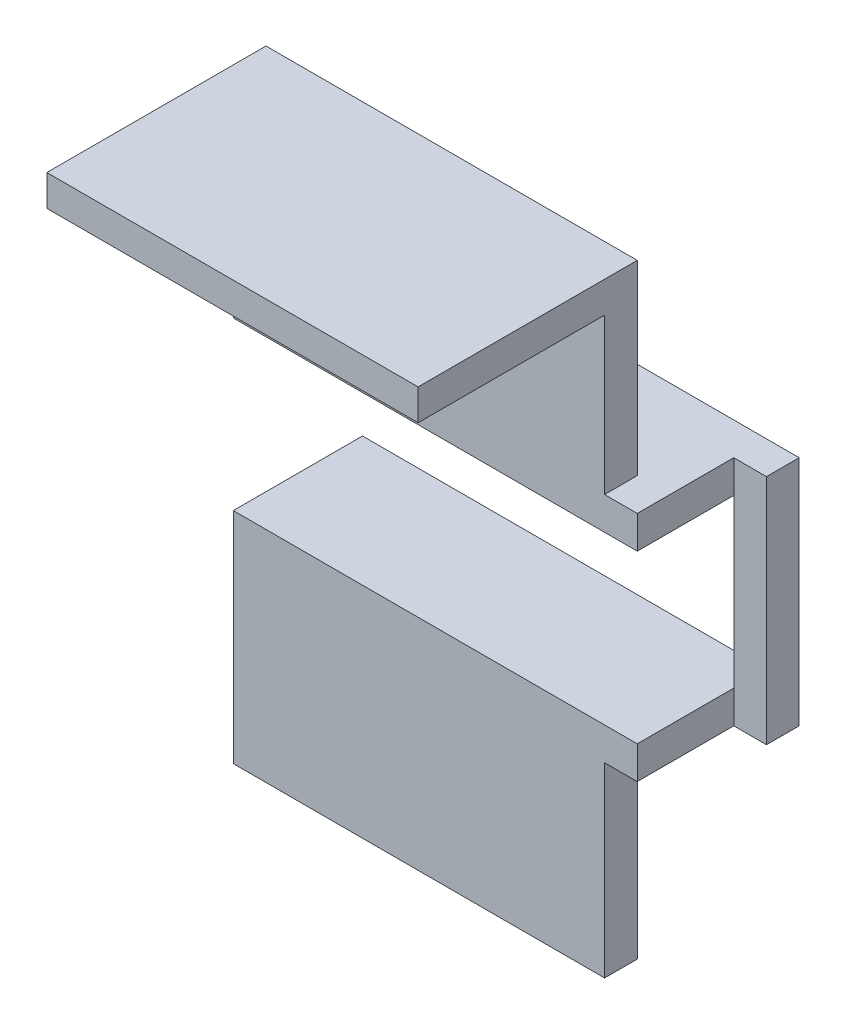
ISO-10303-21;
HEADER;
FILE_DESCRIPTION(('STEP AP214'),'2;1');
FILE_NAME('part.step','',(''),(''),'','','');
FILE_SCHEMA(('AUTOMOTIVE_DESIGN { 1 0 10303 214 1 1 1 1 }'));
ENDSEC;
DATA;
#1=APPLICATION_CONTEXT('core data for automotive mechanical design processes');
#2=APPLICATION_PROTOCOL_DEFINITION('international standard','automotive_design',2000,#1);
#3=PRODUCT_CONTEXT('',#1,'mechanical');
#4=PRODUCT('Part','Part','',(#3));
#5=PRODUCT_RELATED_PRODUCT_CATEGORY('part','',(#4));
#6=PRODUCT_DEFINITION_FORMATION('','',#4);
#7=PRODUCT_DEFINITION_CONTEXT('part definition',#1,'design');
#8=PRODUCT_DEFINITION('design','',#6,#7);
#9=PRODUCT_DEFINITION_SHAPE('','',#8);
#10=(LENGTH_UNIT() NAMED_UNIT(*) SI_UNIT(.MILLI.,.METRE.));
#11=(NAMED_UNIT(*) PLANE_ANGLE_UNIT() SI_UNIT($,.RADIAN.));
#12=(NAMED_UNIT(*) SI_UNIT($,.STERADIAN.) SOLID_ANGLE_UNIT());
#13=UNCERTAINTY_MEASURE_WITH_UNIT(LENGTH_MEASURE(1.E-05),#10,'distance_accuracy_value','');
#14=(GEOMETRIC_REPRESENTATION_CONTEXT(3) GLOBAL_UNCERTAINTY_ASSIGNED_CONTEXT((#13)) GLOBAL_UNIT_ASSIGNED_CONTEXT((#10,
#11,#12)) REPRESENTATION_CONTEXT('',''));
#15=CARTESIAN_POINT('',(0.,0.,0.));
#16=DIRECTION('',(0.,0.,1.));
#17=DIRECTION('',(1.,0.,0.));
#18=AXIS2_PLACEMENT_3D('',#15,#16,#17);
#19=CARTESIAN_POINT('',(9.9,13.4,4.));
#20=DIRECTION('',(-1.,0.,0.));
#21=DIRECTION('',(0.,0.,1.));
#22=AXIS2_PLACEMENT_3D('',#19,#20,#21);
#23=PLANE('',#22);
#24=DIRECTION('',(0.,-1.,0.));
#25=VECTOR('',#24,1.);
#26=CARTESIAN_POINT('',(9.9,11.4,-7.8));
#27=LINE('',#26,#25);
#28=CARTESIAN_POINT('',(9.9,15.4,-7.8));
#29=VERTEX_POINT('',#28);
#30=CARTESIAN_POINT('',(9.9,11.4,-7.8));
#31=VERTEX_POINT('',#30);
#32=EDGE_CURVE('E11',#29,#31,#27,.T.);
#33=ORIENTED_EDGE('',*,*,#32,.F.);
#34=DIRECTION('',(0.,0.,-1.));
#35=VECTOR('',#34,1.);
#36=CARTESIAN_POINT('',(9.9,15.4,0.));
#37=LINE('',#36,#35);
#38=CARTESIAN_POINT('',(9.9,15.4,4.));
#39=VERTEX_POINT('',#38);
#40=EDGE_CURVE('E294',#39,#29,#37,.T.);
#41=ORIENTED_EDGE('',*,*,#40,.F.);
#42=DIRECTION('',(0.,-1.,0.));
#43=VECTOR('',#42,1.);
#44=CARTESIAN_POINT('',(9.9,13.4,4.));
#45=LINE('',#44,#43);
#46=CARTESIAN_POINT('',(9.9,11.4,4.));
#47=VERTEX_POINT('',#46);
#48=EDGE_CURVE('E300',#39,#47,#45,.T.);
#49=ORIENTED_EDGE('',*,*,#48,.T.);
#50=DIRECTION('',(0.,0.,-1.));
#51=VECTOR('',#50,1.);
#52=CARTESIAN_POINT('',(9.9,11.4,4.));
#53=LINE('',#52,#51);
#54=EDGE_CURVE('E298',#47,#31,#53,.T.);
#55=ORIENTED_EDGE('',*,*,#54,.T.);
#56=EDGE_LOOP('',(#33,#41,#49,#55));
#57=FACE_BOUND('',#56,.T.);
#58=ADVANCED_FACE('F37',(#57),#23,.F.);
#59=CARTESIAN_POINT('',(0.,0.,0.));
#60=DIRECTION('',(0.,0.,1.));
#61=DIRECTION('',(1.,0.,0.));
#62=AXIS2_PLACEMENT_3D('',#59,#60,#61);
#63=PLANE('',#62);
#64=DIRECTION('',(-1.,0.,0.));
#65=VECTOR('',#64,1.);
#66=CARTESIAN_POINT('',(9.9,11.4,0.));
#67=LINE('',#66,#65);
#68=CARTESIAN_POINT('',(5.9,11.4,0.));
#69=VERTEX_POINT('',#68);
#70=CARTESIAN_POINT('',(-39.5,11.4,0.));
#71=VERTEX_POINT('',#70);
#72=EDGE_CURVE('E46',#69,#71,#67,.T.);
#73=ORIENTED_EDGE('',*,*,#72,.F.);
#74=DIRECTION('',(0.,1.,0.));
#75=VECTOR('',#74,1.);
#76=CARTESIAN_POINT('',(5.9,11.4,0.));
#77=LINE('',#76,#75);
#78=CARTESIAN_POINT('',(5.9,-11.4,0.));
#79=VERTEX_POINT('',#78);
#80=EDGE_CURVE('E307',#79,#69,#77,.T.);
#81=ORIENTED_EDGE('',*,*,#80,.F.);
#82=DIRECTION('',(1.,0.,0.));
#83=VECTOR('',#82,1.);
#84=CARTESIAN_POINT('',(-5.9,-11.4,0.));
#85=LINE('',#84,#83);
#86=CARTESIAN_POINT('',(-39.5,-11.4,0.));
#87=VERTEX_POINT('',#86);
#88=EDGE_CURVE('E303',#87,#79,#85,.T.);
#89=ORIENTED_EDGE('',*,*,#88,.F.);
#90=DIRECTION('',(0.,-1.,0.));
#91=VECTOR('',#90,1.);
#92=CARTESIAN_POINT('',(-39.5,11.4,0.));
#93=LINE('',#92,#91);
#94=EDGE_CURVE('E228',#71,#87,#93,.T.);
#95=ORIENTED_EDGE('',*,*,#94,.F.);
#96=EDGE_LOOP('',(#73,#81,#89,#95));
#97=FACE_BOUND('',#96,.T.);
#98=ADVANCED_FACE('F324',(#97),#63,.F.);
#99=CARTESIAN_POINT('',(-5.9,-11.4,4.));
#100=DIRECTION('',(0.,1.,0.));
#101=DIRECTION('',(0.,0.,1.));
#102=AXIS2_PLACEMENT_3D('',#99,#100,#101);
#103=PLANE('',#102);
#104=ORIENTED_EDGE('',*,*,#88,.T.);
#105=DIRECTION('',(0.,0.,-1.));
#106=VECTOR('',#105,1.);
#107=CARTESIAN_POINT('',(5.9,-11.4,4.));
#108=LINE('',#107,#106);
#109=CARTESIAN_POINT('',(5.9,-11.4,4.));
#110=VERTEX_POINT('',#109);
#111=EDGE_CURVE('E41',#110,#79,#108,.T.);
#112=ORIENTED_EDGE('',*,*,#111,.F.);
#113=DIRECTION('',(1.,0.,0.));
#114=VECTOR('',#113,1.);
#115=CARTESIAN_POINT('',(-5.9,-11.4,4.));
#116=LINE('',#115,#114);
#117=CARTESIAN_POINT('',(-39.5,-11.4,4.));
#118=VERTEX_POINT('',#117);
#119=EDGE_CURVE('E304',#118,#110,#116,.T.);
#120=ORIENTED_EDGE('',*,*,#119,.F.);
#121=DIRECTION('',(0.,0.,1.));
#122=VECTOR('',#121,1.);
#123=CARTESIAN_POINT('',(-39.5,-11.4,0.));
#124=LINE('',#123,#122);
#125=EDGE_CURVE('E265',#87,#118,#124,.T.);
#126=ORIENTED_EDGE('',*,*,#125,.F.);
#127=EDGE_LOOP('',(#104,#112,#120,#126));
#128=FACE_BOUND('',#127,.T.);
#129=ADVANCED_FACE('F39',(#128),#103,.F.);
#130=CARTESIAN_POINT('',(5.9,11.4,4.));
#131=DIRECTION('',(-1.,0.,0.));
#132=DIRECTION('',(0.,-1.,0.));
#133=AXIS2_PLACEMENT_3D('',#130,#131,#132);
#134=PLANE('',#133);
#135=ORIENTED_EDGE('',*,*,#80,.T.);
#136=DIRECTION('',(0.,0.,-1.));
#137=VECTOR('',#136,1.);
#138=CARTESIAN_POINT('',(5.9,11.4,4.));
#139=LINE('',#138,#137);
#140=CARTESIAN_POINT('',(5.9,11.4,4.));
#141=VERTEX_POINT('',#140);
#142=EDGE_CURVE('E309',#141,#69,#139,.T.);
#143=ORIENTED_EDGE('',*,*,#142,.F.);
#144=DIRECTION('',(0.,1.,0.));
#145=VECTOR('',#144,1.);
#146=CARTESIAN_POINT('',(5.9,11.4,4.));
#147=LINE('',#146,#145);
#148=EDGE_CURVE('E306',#110,#141,#147,.T.);
#149=ORIENTED_EDGE('',*,*,#148,.F.);
#150=ORIENTED_EDGE('',*,*,#111,.T.);
#151=EDGE_LOOP('',(#135,#143,#149,#150));
#152=FACE_BOUND('',#151,.T.);
#153=ADVANCED_FACE('F321',(#152),#134,.F.);
#154=CARTESIAN_POINT('',(0.,0.,4.));
#155=DIRECTION('',(0.,0.,1.));
#156=DIRECTION('',(1.,0.,0.));
#157=AXIS2_PLACEMENT_3D('',#154,#155,#156);
#158=PLANE('',#157);
#159=DIRECTION('',(1.,0.,0.));
#160=VECTOR('',#159,1.);
#161=CARTESIAN_POINT('',(-5.9,15.4,4.));
#162=LINE('',#161,#160);
#163=CARTESIAN_POINT('',(-39.5,15.4,4.));
#164=VERTEX_POINT('',#163);
#165=EDGE_CURVE('E289',#164,#39,#162,.T.);
#166=ORIENTED_EDGE('',*,*,#165,.F.);
#167=DIRECTION('',(0.,1.,0.));
#168=VECTOR('',#167,1.);
#169=CARTESIAN_POINT('',(-39.5,11.4,4.));
#170=LINE('',#169,#168);
#171=EDGE_CURVE('E268',#118,#164,#170,.T.);
#172=ORIENTED_EDGE('',*,*,#171,.F.);
#173=ORIENTED_EDGE('',*,*,#119,.T.);
#174=ORIENTED_EDGE('',*,*,#148,.T.);
#175=DIRECTION('',(1.,0.,0.));
#176=VECTOR('',#175,1.);
#177=CARTESIAN_POINT('',(-5.9,11.4,4.));
#178=LINE('',#177,#176);
#179=EDGE_CURVE('E296',#141,#47,#178,.T.);
#180=ORIENTED_EDGE('',*,*,#179,.T.);
#181=ORIENTED_EDGE('',*,*,#48,.F.);
#182=EDGE_LOOP('',(#166,#172,#173,#174,#180,#181));
#183=FACE_BOUND('',#182,.T.);
#184=ADVANCED_FACE('F348',(#183),#158,.T.);
#185=CARTESIAN_POINT('',(0.,11.4,0.));
#186=DIRECTION('',(0.,-1.,0.));
#187=DIRECTION('',(0.,0.,-1.));
#188=AXIS2_PLACEMENT_3D('',#185,#186,#187);
#189=PLANE('',#188);
#190=ORIENTED_EDGE('',*,*,#179,.F.);
#191=ORIENTED_EDGE('',*,*,#142,.T.);
#192=ORIENTED_EDGE('',*,*,#72,.T.);
#193=DIRECTION('',(0.,0.,1.));
#194=VECTOR('',#193,1.);
#195=CARTESIAN_POINT('',(-39.5,11.4,-11.8));
#196=LINE('',#195,#194);
#197=CARTESIAN_POINT('',(-39.5,11.4,-11.8));
#198=VERTEX_POINT('',#197);
#199=EDGE_CURVE('E209',#198,#71,#196,.T.);
#200=ORIENTED_EDGE('',*,*,#199,.F.);
#201=DIRECTION('',(-1.,0.,0.));
#202=VECTOR('',#201,1.);
#203=CARTESIAN_POINT('',(9.9,11.4,-11.8));
#204=LINE('',#203,#202);
#205=CARTESIAN_POINT('',(13.9,11.4,-11.8));
#206=VERTEX_POINT('',#205);
#207=EDGE_CURVE('E284',#206,#198,#204,.T.);
#208=ORIENTED_EDGE('',*,*,#207,.F.);
#209=DIRECTION('',(0.,0.,-1.));
#210=VECTOR('',#209,1.);
#211=CARTESIAN_POINT('',(13.9,11.4,-11.8));
#212=LINE('',#211,#210);
#213=CARTESIAN_POINT('',(13.9,11.4,-7.8));
#214=VERTEX_POINT('',#213);
#215=EDGE_CURVE('E276',#214,#206,#212,.T.);
#216=ORIENTED_EDGE('',*,*,#215,.F.);
#217=DIRECTION('',(-1.,0.,0.));
#218=VECTOR('',#217,1.);
#219=CARTESIAN_POINT('',(13.9,11.4,-7.8));
#220=LINE('',#219,#218);
#221=EDGE_CURVE('E279',#214,#31,#220,.T.);
#222=ORIENTED_EDGE('',*,*,#221,.T.);
#223=ORIENTED_EDGE('',*,*,#54,.F.);
#224=EDGE_LOOP('',(#190,#191,#192,#200,#208,#216,#222,#223));
#225=FACE_BOUND('',#224,.T.);
#226=ADVANCED_FACE('F328',(#225),#189,.T.);
#227=CARTESIAN_POINT('',(0.,15.4,0.));
#228=DIRECTION('',(0.,1.,0.));
#229=DIRECTION('',(0.,0.,1.));
#230=AXIS2_PLACEMENT_3D('',#227,#228,#229);
#231=PLANE('',#230);
#232=DIRECTION('',(1.,0.,0.));
#233=VECTOR('',#232,1.);
#234=CARTESIAN_POINT('',(9.9,15.4,-11.8));
#235=LINE('',#234,#233);
#236=CARTESIAN_POINT('',(-39.5,15.4,-11.8));
#237=VERTEX_POINT('',#236);
#238=CARTESIAN_POINT('',(9.9,15.4,-11.8));
#239=VERTEX_POINT('',#238);
#240=EDGE_CURVE('E286',#237,#239,#235,.T.);
#241=ORIENTED_EDGE('',*,*,#240,.F.);
#242=DIRECTION('',(0.,0.,-1.));
#243=VECTOR('',#242,1.);
#244=CARTESIAN_POINT('',(-39.5,15.4,-11.8));
#245=LINE('',#244,#243);
#246=EDGE_CURVE('E212',#164,#237,#245,.T.);
#247=ORIENTED_EDGE('',*,*,#246,.F.);
#248=ORIENTED_EDGE('',*,*,#165,.T.);
#249=ORIENTED_EDGE('',*,*,#40,.T.);
#250=EDGE_CURVE('E293',#29,#239,#37,.T.);
#251=ORIENTED_EDGE('',*,*,#250,.T.);
#252=EDGE_LOOP('',(#241,#247,#248,#249,#251));
#253=FACE_BOUND('',#252,.T.);
#254=ADVANCED_FACE('F351',(#253),#231,.T.);
#255=CARTESIAN_POINT('',(0.,0.,-11.8));
#256=DIRECTION('',(0.,0.,-1.));
#257=DIRECTION('',(-1.,0.,0.));
#258=AXIS2_PLACEMENT_3D('',#255,#256,#257);
#259=PLANE('',#258);
#260=ORIENTED_EDGE('',*,*,#240,.T.);
#261=DIRECTION('',(0.,1.,0.));
#262=VECTOR('',#261,1.);
#263=CARTESIAN_POINT('',(9.9,11.4,-11.8));
#264=LINE('',#263,#262);
#265=CARTESIAN_POINT('',(9.9,35.8,-11.8));
#266=VERTEX_POINT('',#265);
#267=EDGE_CURVE('E271',#239,#266,#264,.T.);
#268=ORIENTED_EDGE('',*,*,#267,.T.);
#269=DIRECTION('',(1.,0.,0.));
#270=VECTOR('',#269,1.);
#271=CARTESIAN_POINT('',(9.9,35.8,-11.8));
#272=LINE('',#271,#270);
#273=CARTESIAN_POINT('',(-39.5,35.8,-11.8));
#274=VERTEX_POINT('',#273);
#275=EDGE_CURVE('E233',#274,#266,#272,.T.);
#276=ORIENTED_EDGE('',*,*,#275,.F.);
#277=DIRECTION('',(0.,-1.,0.));
#278=VECTOR('',#277,1.);
#279=CARTESIAN_POINT('',(-39.5,39.8,-11.8));
#280=LINE('',#279,#278);
#281=CARTESIAN_POINT('',(-39.5,39.8,-11.8));
#282=VERTEX_POINT('',#281);
#283=EDGE_CURVE('E194',#282,#274,#280,.T.);
#284=ORIENTED_EDGE('',*,*,#283,.F.);
#285=DIRECTION('',(-1.,0.,0.));
#286=VECTOR('',#285,1.);
#287=CARTESIAN_POINT('',(9.9,39.8,-11.8));
#288=LINE('',#287,#286);
#289=CARTESIAN_POINT('',(13.9,39.8,-11.8));
#290=VERTEX_POINT('',#289);
#291=EDGE_CURVE('E231',#290,#282,#288,.T.);
#292=ORIENTED_EDGE('',*,*,#291,.F.);
#293=DIRECTION('',(0.,1.,0.));
#294=VECTOR('',#293,1.);
#295=CARTESIAN_POINT('',(13.9,11.4,-11.8));
#296=LINE('',#295,#294);
#297=EDGE_CURVE('E272',#206,#290,#296,.T.);
#298=ORIENTED_EDGE('',*,*,#297,.F.);
#299=ORIENTED_EDGE('',*,*,#207,.T.);
#300=DIRECTION('',(0.,-1.,0.));
#301=VECTOR('',#300,1.);
#302=CARTESIAN_POINT('',(-39.5,15.4,-11.8));
#303=LINE('',#302,#301);
#304=EDGE_CURVE('E206',#237,#198,#303,.T.);
#305=ORIENTED_EDGE('',*,*,#304,.F.);
#306=EDGE_LOOP('',(#260,#268,#276,#284,#292,#298,#299,#305));
#307=FACE_BOUND('',#306,.T.);
#308=ADVANCED_FACE('F334',(#307),#259,.T.);
#309=CARTESIAN_POINT('',(13.9,11.4,-7.8));
#310=DIRECTION('',(0.,0.,-1.));
#311=DIRECTION('',(-1.,0.,0.));
#312=AXIS2_PLACEMENT_3D('',#309,#310,#311);
#313=PLANE('',#312);
#314=CARTESIAN_POINT('',(9.9,35.8,-7.8));
#315=VERTEX_POINT('',#314);
#316=EDGE_CURVE('E48',#315,#29,#27,.T.);
#317=ORIENTED_EDGE('',*,*,#316,.T.);
#318=ORIENTED_EDGE('',*,*,#32,.T.);
#319=ORIENTED_EDGE('',*,*,#221,.F.);
#320=DIRECTION('',(0.,-1.,0.));
#321=VECTOR('',#320,1.);
#322=CARTESIAN_POINT('',(13.9,11.4,-7.8));
#323=LINE('',#322,#321);
#324=CARTESIAN_POINT('',(13.9,39.8,-7.8));
#325=VERTEX_POINT('',#324);
#326=EDGE_CURVE('E274',#325,#214,#323,.T.);
#327=ORIENTED_EDGE('',*,*,#326,.F.);
#328=DIRECTION('',(-1.,0.,0.));
#329=VECTOR('',#328,1.);
#330=CARTESIAN_POINT('',(13.9,39.8,-7.8));
#331=LINE('',#330,#329);
#332=CARTESIAN_POINT('',(9.9,39.8,-7.8));
#333=VERTEX_POINT('',#332);
#334=EDGE_CURVE('E224',#325,#333,#331,.T.);
#335=ORIENTED_EDGE('',*,*,#334,.T.);
#336=DIRECTION('',(0.,1.,0.));
#337=VECTOR('',#336,1.);
#338=CARTESIAN_POINT('',(9.9,39.8,-7.8));
#339=LINE('',#338,#337);
#340=EDGE_CURVE('E225',#315,#333,#339,.T.);
#341=ORIENTED_EDGE('',*,*,#340,.F.);
#342=EDGE_LOOP('',(#317,#318,#319,#327,#335,#341));
#343=FACE_BOUND('',#342,.T.);
#344=ADVANCED_FACE('F345',(#343),#313,.F.);
#345=CARTESIAN_POINT('',(13.9,0.,0.));
#346=DIRECTION('',(1.,0.,0.));
#347=DIRECTION('',(0.,0.,-1.));
#348=AXIS2_PLACEMENT_3D('',#345,#346,#347);
#349=PLANE('',#348);
#350=ORIENTED_EDGE('',*,*,#297,.T.);
#351=DIRECTION('',(0.,0.,-1.));
#352=VECTOR('',#351,1.);
#353=CARTESIAN_POINT('',(13.9,39.8,-11.8));
#354=LINE('',#353,#352);
#355=EDGE_CURVE('E221',#325,#290,#354,.T.);
#356=ORIENTED_EDGE('',*,*,#355,.F.);
#357=ORIENTED_EDGE('',*,*,#326,.T.);
#358=ORIENTED_EDGE('',*,*,#215,.T.);
#359=EDGE_LOOP('',(#350,#356,#357,#358));
#360=FACE_BOUND('',#359,.T.);
#361=ADVANCED_FACE('F340',(#360),#349,.T.);
#362=CARTESIAN_POINT('',(9.9,0.,0.));
#363=DIRECTION('',(1.,0.,0.));
#364=DIRECTION('',(0.,0.,-1.));
#365=AXIS2_PLACEMENT_3D('',#362,#363,#364);
#366=PLANE('',#365);
#367=ORIENTED_EDGE('',*,*,#250,.F.);
#368=ORIENTED_EDGE('',*,*,#316,.F.);
#369=DIRECTION('',(0.,0.,-1.));
#370=VECTOR('',#369,1.);
#371=CARTESIAN_POINT('',(9.9,35.8,0.));
#372=LINE('',#371,#370);
#373=EDGE_CURVE('E240',#315,#266,#372,.T.);
#374=ORIENTED_EDGE('',*,*,#373,.T.);
#375=ORIENTED_EDGE('',*,*,#267,.F.);
#376=EDGE_LOOP('',(#367,#368,#374,#375));
#377=FACE_BOUND('',#376,.T.);
#378=ADVANCED_FACE('F354',(#377),#366,.F.);
#379=CARTESIAN_POINT('',(-39.5,0.,0.));
#380=DIRECTION('',(-1.,0.,0.));
#381=DIRECTION('',(0.,-1.,0.));
#382=AXIS2_PLACEMENT_3D('',#379,#380,#381);
#383=PLANE('',#382);
#384=ORIENTED_EDGE('',*,*,#94,.T.);
#385=ORIENTED_EDGE('',*,*,#125,.T.);
#386=ORIENTED_EDGE('',*,*,#171,.T.);
#387=ORIENTED_EDGE('',*,*,#246,.T.);
#388=ORIENTED_EDGE('',*,*,#304,.T.);
#389=ORIENTED_EDGE('',*,*,#199,.T.);
#390=EDGE_LOOP('',(#384,#385,#386,#387,#388,#389));
#391=FACE_BOUND('',#390,.T.);
#392=ADVANCED_FACE('F330',(#391),#383,.T.);
#393=CARTESIAN_POINT('',(9.9,37.8,4.));
#394=DIRECTION('',(-1.,0.,0.));
#395=DIRECTION('',(0.,0.,1.));
#396=AXIS2_PLACEMENT_3D('',#393,#394,#395);
#397=PLANE('',#396);
#398=ORIENTED_EDGE('',*,*,#340,.T.);
#399=DIRECTION('',(0.,0.,-1.));
#400=VECTOR('',#399,1.);
#401=CARTESIAN_POINT('',(9.9,39.8,4.));
#402=LINE('',#401,#400);
#403=CARTESIAN_POINT('',(9.9,39.8,4.));
#404=VERTEX_POINT('',#403);
#405=EDGE_CURVE('E246',#404,#333,#402,.T.);
#406=ORIENTED_EDGE('',*,*,#405,.F.);
#407=DIRECTION('',(0.,1.,0.));
#408=VECTOR('',#407,1.);
#409=CARTESIAN_POINT('',(9.9,37.8,4.));
#410=LINE('',#409,#408);
#411=CARTESIAN_POINT('',(9.9,35.8,4.));
#412=VERTEX_POINT('',#411);
#413=EDGE_CURVE('E249',#412,#404,#410,.T.);
#414=ORIENTED_EDGE('',*,*,#413,.F.);
#415=EDGE_CURVE('E241',#412,#315,#372,.T.);
#416=ORIENTED_EDGE('',*,*,#415,.T.);
#417=EDGE_LOOP('',(#398,#406,#414,#416));
#418=FACE_BOUND('',#417,.T.);
#419=ADVANCED_FACE('F360',(#418),#397,.F.);
#420=CARTESIAN_POINT('',(0.,51.2,0.));
#421=DIRECTION('',(0.,0.,1.));
#422=DIRECTION('',(1.,0.,0.));
#423=AXIS2_PLACEMENT_3D('',#420,#421,#422);
#424=PLANE('',#423);
#425=DIRECTION('',(-1.,0.,0.));
#426=VECTOR('',#425,1.);
#427=CARTESIAN_POINT('',(9.9,39.8,0.));
#428=LINE('',#427,#426);
#429=CARTESIAN_POINT('',(5.9,39.8,0.));
#430=VERTEX_POINT('',#429);
#431=CARTESIAN_POINT('',(-39.5,39.8,0.));
#432=VERTEX_POINT('',#431);
#433=EDGE_CURVE('E229',#430,#432,#428,.T.);
#434=ORIENTED_EDGE('',*,*,#433,.T.);
#435=DIRECTION('',(0.,1.,0.));
#436=VECTOR('',#435,1.);
#437=CARTESIAN_POINT('',(-39.5,39.8,0.));
#438=LINE('',#437,#436);
#439=CARTESIAN_POINT('',(-39.5,62.6,0.));
#440=VERTEX_POINT('',#439);
#441=EDGE_CURVE('E215',#432,#440,#438,.T.);
#442=ORIENTED_EDGE('',*,*,#441,.T.);
#443=DIRECTION('',(1.,0.,0.));
#444=VECTOR('',#443,1.);
#445=CARTESIAN_POINT('',(-5.9,62.6,0.));
#446=LINE('',#445,#444);
#447=CARTESIAN_POINT('',(5.9,62.6,0.));
#448=VERTEX_POINT('',#447);
#449=EDGE_CURVE('E252',#440,#448,#446,.T.);
#450=ORIENTED_EDGE('',*,*,#449,.T.);
#451=DIRECTION('',(0.,-1.,0.));
#452=VECTOR('',#451,1.);
#453=CARTESIAN_POINT('',(5.9,39.8,0.));
#454=LINE('',#453,#452);
#455=EDGE_CURVE('E256',#448,#430,#454,.T.);
#456=ORIENTED_EDGE('',*,*,#455,.T.);
#457=EDGE_LOOP('',(#434,#442,#450,#456));
#458=FACE_BOUND('',#457,.T.);
#459=ADVANCED_FACE('F464',(#458),#424,.F.);
#460=CARTESIAN_POINT('',(-5.9,62.6,4.));
#461=DIRECTION('',(0.,-1.,0.));
#462=DIRECTION('',(0.,0.,1.));
#463=AXIS2_PLACEMENT_3D('',#460,#461,#462);
#464=PLANE('',#463);
#465=ORIENTED_EDGE('',*,*,#449,.F.);
#466=DIRECTION('',(0.,0.,1.));
#467=VECTOR('',#466,1.);
#468=CARTESIAN_POINT('',(-39.5,62.6,0.));
#469=LINE('',#468,#467);
#470=CARTESIAN_POINT('',(-39.5,62.6,26.8));
#471=VERTEX_POINT('',#470);
#472=EDGE_CURVE('E218',#440,#471,#469,.T.);
#473=ORIENTED_EDGE('',*,*,#472,.T.);
#474=DIRECTION('',(-1.,0.,0.));
#475=VECTOR('',#474,1.);
#476=CARTESIAN_POINT('',(-39.5,62.6,26.8));
#477=LINE('',#476,#475);
#478=CARTESIAN_POINT('',(5.9,62.6,26.8));
#479=VERTEX_POINT('',#478);
#480=EDGE_CURVE('E187',#479,#471,#477,.T.);
#481=ORIENTED_EDGE('',*,*,#480,.F.);
#482=DIRECTION('',(0.,0.,-1.));
#483=VECTOR('',#482,1.);
#484=CARTESIAN_POINT('',(5.9,62.6,4.));
#485=LINE('',#484,#483);
#486=EDGE_CURVE('E238',#479,#448,#485,.T.);
#487=ORIENTED_EDGE('',*,*,#486,.T.);
#488=EDGE_LOOP('',(#465,#473,#481,#487));
#489=FACE_BOUND('',#488,.T.);
#490=ADVANCED_FACE('F383',(#489),#464,.F.);
#491=CARTESIAN_POINT('',(5.9,39.8,4.));
#492=DIRECTION('',(-1.,0.,0.));
#493=DIRECTION('',(0.,1.,0.));
#494=AXIS2_PLACEMENT_3D('',#491,#492,#493);
#495=PLANE('',#494);
#496=ORIENTED_EDGE('',*,*,#455,.F.);
#497=ORIENTED_EDGE('',*,*,#486,.F.);
#498=DIRECTION('',(0.,1.,0.));
#499=VECTOR('',#498,1.);
#500=CARTESIAN_POINT('',(5.9,62.6,26.8));
#501=LINE('',#500,#499);
#502=CARTESIAN_POINT('',(5.9,58.8,26.8));
#503=VERTEX_POINT('',#502);
#504=EDGE_CURVE('E180',#503,#479,#501,.T.);
#505=ORIENTED_EDGE('',*,*,#504,.F.);
#506=DIRECTION('',(0.,0.,-1.));
#507=VECTOR('',#506,1.);
#508=CARTESIAN_POINT('',(5.9,58.8,26.8));
#509=LINE('',#508,#507);
#510=CARTESIAN_POINT('',(5.9,58.8,4.));
#511=VERTEX_POINT('',#510);
#512=EDGE_CURVE('E176',#503,#511,#509,.T.);
#513=ORIENTED_EDGE('',*,*,#512,.T.);
#514=DIRECTION('',(0.,-1.,0.));
#515=VECTOR('',#514,1.);
#516=CARTESIAN_POINT('',(5.9,39.8,4.));
#517=LINE('',#516,#515);
#518=CARTESIAN_POINT('',(5.9,39.8,4.));
#519=VERTEX_POINT('',#518);
#520=EDGE_CURVE('E253',#511,#519,#517,.T.);
#521=ORIENTED_EDGE('',*,*,#520,.T.);
#522=DIRECTION('',(0.,0.,-1.));
#523=VECTOR('',#522,1.);
#524=CARTESIAN_POINT('',(5.9,39.8,4.));
#525=LINE('',#524,#523);
#526=EDGE_CURVE('E255',#519,#430,#525,.T.);
#527=ORIENTED_EDGE('',*,*,#526,.T.);
#528=EDGE_LOOP('',(#496,#497,#505,#513,#521,#527));
#529=FACE_BOUND('',#528,.T.);
#530=ADVANCED_FACE('F376',(#529),#495,.F.);
#531=CARTESIAN_POINT('',(0.,51.2,4.));
#532=DIRECTION('',(0.,0.,1.));
#533=DIRECTION('',(1.,0.,0.));
#534=AXIS2_PLACEMENT_3D('',#531,#532,#533);
#535=PLANE('',#534);
#536=DIRECTION('',(1.,0.,0.));
#537=VECTOR('',#536,1.);
#538=CARTESIAN_POINT('',(-39.5,58.8,4.));
#539=LINE('',#538,#537);
#540=CARTESIAN_POINT('',(-39.5,58.8,4.));
#541=VERTEX_POINT('',#540);
#542=EDGE_CURVE('E55',#541,#511,#539,.T.);
#543=ORIENTED_EDGE('',*,*,#542,.F.);
#544=DIRECTION('',(0.,-1.,0.));
#545=VECTOR('',#544,1.);
#546=CARTESIAN_POINT('',(-39.5,39.8,4.));
#547=LINE('',#546,#545);
#548=CARTESIAN_POINT('',(-39.5,35.8,4.));
#549=VERTEX_POINT('',#548);
#550=EDGE_CURVE('E193',#541,#549,#547,.T.);
#551=ORIENTED_EDGE('',*,*,#550,.T.);
#552=DIRECTION('',(1.,0.,0.));
#553=VECTOR('',#552,1.);
#554=CARTESIAN_POINT('',(-5.9,35.8,4.));
#555=LINE('',#554,#553);
#556=EDGE_CURVE('E236',#549,#412,#555,.T.);
#557=ORIENTED_EDGE('',*,*,#556,.T.);
#558=ORIENTED_EDGE('',*,*,#413,.T.);
#559=DIRECTION('',(1.,0.,0.));
#560=VECTOR('',#559,1.);
#561=CARTESIAN_POINT('',(-5.9,39.8,4.));
#562=LINE('',#561,#560);
#563=EDGE_CURVE('E244',#519,#404,#562,.T.);
#564=ORIENTED_EDGE('',*,*,#563,.F.);
#565=ORIENTED_EDGE('',*,*,#520,.F.);
#566=EDGE_LOOP('',(#543,#551,#557,#558,#564,#565));
#567=FACE_BOUND('',#566,.T.);
#568=ADVANCED_FACE('F374',(#567),#535,.T.);
#569=CARTESIAN_POINT('',(0.,39.8,0.));
#570=DIRECTION('',(0.,1.,0.));
#571=DIRECTION('',(0.,0.,-1.));
#572=AXIS2_PLACEMENT_3D('',#569,#570,#571);
#573=PLANE('',#572);
#574=ORIENTED_EDGE('',*,*,#563,.T.);
#575=ORIENTED_EDGE('',*,*,#405,.T.);
#576=ORIENTED_EDGE('',*,*,#334,.F.);
#577=ORIENTED_EDGE('',*,*,#355,.T.);
#578=ORIENTED_EDGE('',*,*,#291,.T.);
#579=DIRECTION('',(0.,0.,-1.));
#580=VECTOR('',#579,1.);
#581=CARTESIAN_POINT('',(-39.5,39.8,-11.8));
#582=LINE('',#581,#580);
#583=EDGE_CURVE('E203',#432,#282,#582,.T.);
#584=ORIENTED_EDGE('',*,*,#583,.F.);
#585=ORIENTED_EDGE('',*,*,#433,.F.);
#586=ORIENTED_EDGE('',*,*,#526,.F.);
#587=EDGE_LOOP('',(#574,#575,#576,#577,#578,#584,#585,#586));
#588=FACE_BOUND('',#587,.T.);
#589=ADVANCED_FACE('F371',(#588),#573,.T.);
#590=CARTESIAN_POINT('',(0.,35.8,0.));
#591=DIRECTION('',(0.,-1.,0.));
#592=DIRECTION('',(0.,0.,1.));
#593=AXIS2_PLACEMENT_3D('',#590,#591,#592);
#594=PLANE('',#593);
#595=ORIENTED_EDGE('',*,*,#556,.F.);
#596=DIRECTION('',(0.,0.,1.));
#597=VECTOR('',#596,1.);
#598=CARTESIAN_POINT('',(-39.5,35.8,-11.8));
#599=LINE('',#598,#597);
#600=EDGE_CURVE('E197',#274,#549,#599,.T.);
#601=ORIENTED_EDGE('',*,*,#600,.F.);
#602=ORIENTED_EDGE('',*,*,#275,.T.);
#603=ORIENTED_EDGE('',*,*,#373,.F.);
#604=ORIENTED_EDGE('',*,*,#415,.F.);
#605=EDGE_LOOP('',(#595,#601,#602,#603,#604));
#606=FACE_BOUND('',#605,.T.);
#607=ADVANCED_FACE('F365',(#606),#594,.T.);
#608=CARTESIAN_POINT('',(-39.5,51.2,0.));
#609=DIRECTION('',(-1.,0.,0.));
#610=DIRECTION('',(0.,1.,0.));
#611=AXIS2_PLACEMENT_3D('',#608,#609,#610);
#612=PLANE('',#611);
#613=ORIENTED_EDGE('',*,*,#441,.F.);
#614=ORIENTED_EDGE('',*,*,#583,.T.);
#615=ORIENTED_EDGE('',*,*,#283,.T.);
#616=ORIENTED_EDGE('',*,*,#600,.T.);
#617=ORIENTED_EDGE('',*,*,#550,.F.);
#618=DIRECTION('',(0.,0.,-1.));
#619=VECTOR('',#618,1.);
#620=CARTESIAN_POINT('',(-39.5,58.8,26.8));
#621=LINE('',#620,#619);
#622=CARTESIAN_POINT('',(-39.5,58.8,26.8));
#623=VERTEX_POINT('',#622);
#624=EDGE_CURVE('E174',#623,#541,#621,.T.);
#625=ORIENTED_EDGE('',*,*,#624,.F.);
#626=DIRECTION('',(0.,-1.,0.));
#627=VECTOR('',#626,1.);
#628=CARTESIAN_POINT('',(-39.5,62.6,26.8));
#629=LINE('',#628,#627);
#630=EDGE_CURVE('E181',#471,#623,#629,.T.);
#631=ORIENTED_EDGE('',*,*,#630,.F.);
#632=ORIENTED_EDGE('',*,*,#472,.F.);
#633=EDGE_LOOP('',(#613,#614,#615,#616,#617,#625,#631,#632));
#634=FACE_BOUND('',#633,.T.);
#635=ADVANCED_FACE('F191',(#634),#612,.T.);
#636=CARTESIAN_POINT('',(-39.5,58.8,26.8));
#637=DIRECTION('',(0.,1.,0.));
#638=DIRECTION('',(0.,0.,1.));
#639=AXIS2_PLACEMENT_3D('',#636,#637,#638);
#640=PLANE('',#639);
#641=ORIENTED_EDGE('',*,*,#542,.T.);
#642=ORIENTED_EDGE('',*,*,#512,.F.);
#643=DIRECTION('',(1.,0.,0.));
#644=VECTOR('',#643,1.);
#645=CARTESIAN_POINT('',(-39.5,58.8,26.8));
#646=LINE('',#645,#644);
#647=EDGE_CURVE('E170',#623,#503,#646,.T.);
#648=ORIENTED_EDGE('',*,*,#647,.F.);
#649=ORIENTED_EDGE('',*,*,#624,.T.);
#650=EDGE_LOOP('',(#641,#642,#648,#649));
#651=FACE_BOUND('',#650,.T.);
#652=ADVANCED_FACE('F172',(#651),#640,.F.);
#653=CARTESIAN_POINT('',(0.,0.,26.8));
#654=DIRECTION('',(0.,0.,1.));
#655=DIRECTION('',(1.,0.,0.));
#656=AXIS2_PLACEMENT_3D('',#653,#654,#655);
#657=PLANE('',#656);
#658=ORIENTED_EDGE('',*,*,#630,.T.);
#659=ORIENTED_EDGE('',*,*,#647,.T.);
#660=ORIENTED_EDGE('',*,*,#504,.T.);
#661=ORIENTED_EDGE('',*,*,#480,.T.);
#662=EDGE_LOOP('',(#658,#659,#660,#661));
#663=FACE_BOUND('',#662,.T.);
#664=ADVANCED_FACE('F185',(#663),#657,.T.);
#665=CLOSED_SHELL('',(#58,#98,#129,#153,#184,#226,#254,#308,#344,#361,#378,#392,#419,#459,#490,
#530,#568,#589,#607,#635,#652,#664));
#666=MANIFOLD_SOLID_BREP('B2',#665);
#667=ADVANCED_BREP_SHAPE_REPRESENTATION('',(#18,#666),#14);
#668=SHAPE_DEFINITION_REPRESENTATION(#9,#667);
ENDSEC;
END-ISO-10303-21;
